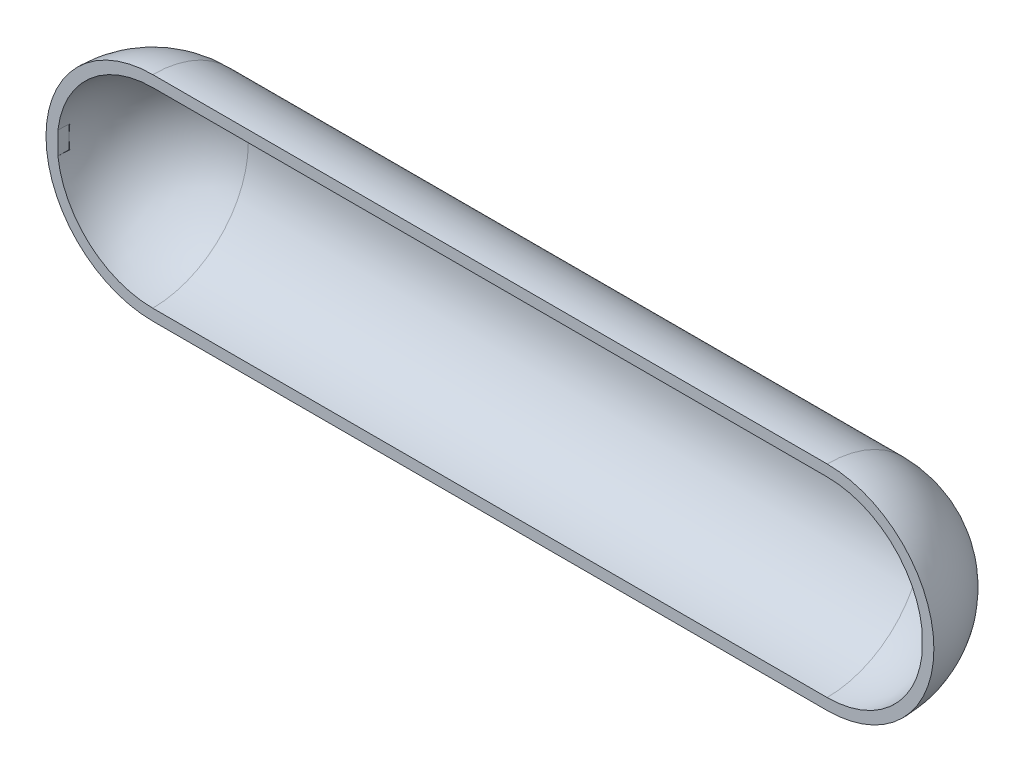
ISO-10303-21;
HEADER;
FILE_DESCRIPTION(('STEP AP214'),'2;1');
FILE_NAME('part.step','',(''),(''),'','','');
FILE_SCHEMA(('AUTOMOTIVE_DESIGN { 1 0 10303 214 1 1 1 1 }'));
ENDSEC;
DATA;
#1=APPLICATION_CONTEXT('core data for automotive mechanical design processes');
#2=APPLICATION_PROTOCOL_DEFINITION('international standard','automotive_design',2000,#1);
#3=PRODUCT_CONTEXT('',#1,'mechanical');
#4=PRODUCT('Part','Part','',(#3));
#5=PRODUCT_RELATED_PRODUCT_CATEGORY('part','',(#4));
#6=PRODUCT_DEFINITION_FORMATION('','',#4);
#7=PRODUCT_DEFINITION_CONTEXT('part definition',#1,'design');
#8=PRODUCT_DEFINITION('design','',#6,#7);
#9=PRODUCT_DEFINITION_SHAPE('','',#8);
#10=(LENGTH_UNIT() NAMED_UNIT(*) SI_UNIT(.MILLI.,.METRE.));
#11=(NAMED_UNIT(*) PLANE_ANGLE_UNIT() SI_UNIT($,.RADIAN.));
#12=(NAMED_UNIT(*) SI_UNIT($,.STERADIAN.) SOLID_ANGLE_UNIT());
#13=UNCERTAINTY_MEASURE_WITH_UNIT(LENGTH_MEASURE(1.E-05),#10,'distance_accuracy_value','');
#14=(GEOMETRIC_REPRESENTATION_CONTEXT(3) GLOBAL_UNCERTAINTY_ASSIGNED_CONTEXT((#13)) GLOBAL_UNIT_ASSIGNED_CONTEXT((#10,
#11,#12)) REPRESENTATION_CONTEXT('',''));
#15=CARTESIAN_POINT('',(0.,0.,0.));
#16=DIRECTION('',(0.,0.,1.));
#17=DIRECTION('',(1.,0.,0.));
#18=AXIS2_PLACEMENT_3D('',#15,#16,#17);
#19=CARTESIAN_POINT('',(-3000.,0.,0.));
#20=DIRECTION('',(0.,0.,1.));
#21=DIRECTION('',(1.,0.,0.));
#22=AXIS2_PLACEMENT_3D('',#19,#20,#21);
#23=PLANE('',#22);
#24=DIRECTION('',(0.,1.,0.));
#25=VECTOR('',#24,1.);
#26=CARTESIAN_POINT('',(3844.09715080671,-99.9999999999999,0.));
#27=LINE('',#26,#25);
#28=CARTESIAN_POINT('',(3844.09715080671,-99.9999999999999,0.));
#29=VERTEX_POINT('',#28);
#30=CARTESIAN_POINT('',(3844.09715080671,99.9999999999999,0.));
#31=VERTEX_POINT('',#30);
#32=EDGE_CURVE('E128',#29,#31,#27,.T.);
#33=ORIENTED_EDGE('',*,*,#32,.F.);
#34=CARTESIAN_POINT('',(3000.,0.,0.));
#35=DIRECTION('',(0.,0.,-1.));
#36=DIRECTION('',(1.,0.,0.));
#37=AXIS2_PLACEMENT_3D('',#34,#35,#36);
#38=CIRCLE('',#37,850.);
#39=CARTESIAN_POINT('',(3000.,-850.,5.93551827603332E-12));
#40=VERTEX_POINT('',#39);
#41=EDGE_CURVE('E205',#29,#40,#38,.T.);
#42=ORIENTED_EDGE('',*,*,#41,.T.);
#43=DIRECTION('',(1.,0.,0.));
#44=VECTOR('',#43,1.);
#45=CARTESIAN_POINT('',(0.,-850.,5.93551827603332E-12));
#46=LINE('',#45,#44);
#47=CARTESIAN_POINT('',(-3000.,-850.,5.93551827603333E-12));
#48=VERTEX_POINT('',#47);
#49=EDGE_CURVE('E201',#48,#40,#46,.T.);
#50=ORIENTED_EDGE('',*,*,#49,.F.);
#51=CARTESIAN_POINT('',(-3000.,2.04702037756213E-13,0.));
#52=DIRECTION('',(0.,0.,-1.));
#53=DIRECTION('',(1.,0.,0.));
#54=AXIS2_PLACEMENT_3D('',#51,#52,#53);
#55=CIRCLE('',#54,850.);
#56=CARTESIAN_POINT('',(-3844.09715080671,-99.9999999999999,0.));
#57=VERTEX_POINT('',#56);
#58=EDGE_CURVE('E197',#48,#57,#55,.T.);
#59=ORIENTED_EDGE('',*,*,#58,.T.);
#60=DIRECTION('',(0.,-1.,0.));
#61=VECTOR('',#60,1.);
#62=CARTESIAN_POINT('',(-3844.09715080671,100.,0.));
#63=LINE('',#62,#61);
#64=CARTESIAN_POINT('',(-3844.09715080671,100.,0.));
#65=VERTEX_POINT('',#64);
#66=EDGE_CURVE('E158',#65,#57,#63,.T.);
#67=ORIENTED_EDGE('',*,*,#66,.F.);
#68=CARTESIAN_POINT('',(-3000.,0.,0.));
#69=DIRECTION('',(0.,0.,1.));
#70=DIRECTION('',(1.,0.,0.));
#71=AXIS2_PLACEMENT_3D('',#68,#69,#70);
#72=CIRCLE('',#71,850.);
#73=CARTESIAN_POINT('',(-3000.,850.,0.));
#74=VERTEX_POINT('',#73);
#75=EDGE_CURVE('E185',#74,#65,#72,.T.);
#76=ORIENTED_EDGE('',*,*,#75,.F.);
#77=DIRECTION('',(1.,0.,0.));
#78=VECTOR('',#77,1.);
#79=CARTESIAN_POINT('',(0.,850.,0.));
#80=LINE('',#79,#78);
#81=CARTESIAN_POINT('',(3000.,850.,0.));
#82=VERTEX_POINT('',#81);
#83=EDGE_CURVE('E189',#74,#82,#80,.T.);
#84=ORIENTED_EDGE('',*,*,#83,.T.);
#85=CARTESIAN_POINT('',(3000.,0.,0.));
#86=DIRECTION('',(0.,0.,1.));
#87=DIRECTION('',(1.,0.,0.));
#88=AXIS2_PLACEMENT_3D('',#85,#86,#87);
#89=CIRCLE('',#88,850.);
#90=EDGE_CURVE('E193',#31,#82,#89,.T.);
#91=ORIENTED_EDGE('',*,*,#90,.F.);
#92=EDGE_LOOP('',(#33,#42,#50,#59,#67,#76,#84,#91));
#93=FACE_BOUND('',#92,.T.);
#94=DIRECTION('',(1.,0.,0.));
#95=VECTOR('',#94,1.);
#96=CARTESIAN_POINT('',(0.,950.,0.));
#97=LINE('',#96,#95);
#98=CARTESIAN_POINT('',(-3000.,950.,0.));
#99=VERTEX_POINT('',#98);
#100=CARTESIAN_POINT('',(3000.,950.,0.));
#101=VERTEX_POINT('',#100);
#102=EDGE_CURVE('E216',#99,#101,#97,.T.);
#103=ORIENTED_EDGE('',*,*,#102,.F.);
#104=CARTESIAN_POINT('',(-3000.,2.04702037756213E-13,0.));
#105=DIRECTION('',(0.,0.,-1.));
#106=DIRECTION('',(1.,0.,0.));
#107=AXIS2_PLACEMENT_3D('',#104,#105,#106);
#108=CIRCLE('',#107,950.);
#109=CARTESIAN_POINT('',(-3000.,-950.,6.63381454380195E-12));
#110=VERTEX_POINT('',#109);
#111=EDGE_CURVE('E220',#110,#99,#108,.T.);
#112=ORIENTED_EDGE('',*,*,#111,.F.);
#113=DIRECTION('',(1.,0.,0.));
#114=VECTOR('',#113,1.);
#115=CARTESIAN_POINT('',(0.,-950.,6.63381454380195E-12));
#116=LINE('',#115,#114);
#117=CARTESIAN_POINT('',(3000.,-950.,6.63381454380195E-12));
#118=VERTEX_POINT('',#117);
#119=EDGE_CURVE('E223',#110,#118,#116,.T.);
#120=ORIENTED_EDGE('',*,*,#119,.T.);
#121=CARTESIAN_POINT('',(3000.,0.,0.));
#122=DIRECTION('',(0.,0.,-1.));
#123=DIRECTION('',(1.,0.,0.));
#124=AXIS2_PLACEMENT_3D('',#121,#122,#123);
#125=CIRCLE('',#124,950.);
#126=EDGE_CURVE('E227',#101,#118,#125,.T.);
#127=ORIENTED_EDGE('',*,*,#126,.F.);
#128=EDGE_LOOP('',(#103,#112,#120,#127));
#129=FACE_BOUND('',#128,.T.);
#130=ADVANCED_FACE('F39',(#93,#129),#23,.T.);
#131=CARTESIAN_POINT('',(3000.,0.,0.));
#132=DIRECTION('',(1.,0.,0.));
#133=DIRECTION('',(0.,1.,0.));
#134=AXIS2_PLACEMENT_3D('',#131,#132,#133);
#135=SPHERICAL_SURFACE('',#134,950.);
#136=CARTESIAN_POINT('',(3000.,0.,0.));
#137=DIRECTION('',(1.,0.,0.));
#138=DIRECTION('',(0.,1.,0.));
#139=AXIS2_PLACEMENT_3D('',#136,#137,#138);
#140=CIRCLE('',#139,950.);
#141=EDGE_CURVE('E235',#118,#101,#140,.T.);
#142=ORIENTED_EDGE('',*,*,#141,.T.);
#143=ORIENTED_EDGE('',*,*,#126,.T.);
#144=EDGE_LOOP('',(#142,#143));
#145=FACE_BOUND('',#144,.T.);
#146=ADVANCED_FACE('F41',(#145),#135,.T.);
#147=CARTESIAN_POINT('',(3950.,0.,0.));
#148=DIRECTION('',(1.,0.,0.));
#149=DIRECTION('',(0.,1.,0.));
#150=AXIS2_PLACEMENT_3D('',#147,#148,#149);
#151=CYLINDRICAL_SURFACE('',#150,950.);
#152=CARTESIAN_POINT('',(-3000.,1.02351018878106E-13,0.));
#153=DIRECTION('',(1.,0.,0.));
#154=DIRECTION('',(0.,1.,0.));
#155=AXIS2_PLACEMENT_3D('',#152,#153,#154);
#156=CIRCLE('',#155,950.);
#157=EDGE_CURVE('E231',#110,#99,#156,.T.);
#158=ORIENTED_EDGE('',*,*,#157,.T.);
#159=ORIENTED_EDGE('',*,*,#102,.T.);
#160=ORIENTED_EDGE('',*,*,#141,.F.);
#161=ORIENTED_EDGE('',*,*,#119,.F.);
#162=EDGE_LOOP('',(#158,#159,#160,#161));
#163=FACE_BOUND('',#162,.T.);
#164=ADVANCED_FACE('F281',(#163),#151,.T.);
#165=CARTESIAN_POINT('',(-3000.,2.04702037756213E-13,0.));
#166=DIRECTION('',(1.,0.,0.));
#167=DIRECTION('',(0.,-1.,0.));
#168=AXIS2_PLACEMENT_3D('',#165,#166,#167);
#169=SPHERICAL_SURFACE('',#168,950.);
#170=ORIENTED_EDGE('',*,*,#111,.T.);
#171=ORIENTED_EDGE('',*,*,#157,.F.);
#172=EDGE_LOOP('',(#170,#171));
#173=FACE_BOUND('',#172,.T.);
#174=ADVANCED_FACE('F287',(#173),#169,.T.);
#175=CARTESIAN_POINT('',(3000.,0.,0.));
#176=DIRECTION('',(1.,0.,0.));
#177=DIRECTION('',(0.,-1.,0.));
#178=AXIS2_PLACEMENT_3D('',#175,#176,#177);
#179=SPHERICAL_SURFACE('',#178,850.);
#180=CARTESIAN_POINT('',(3000.,0.,-100.));
#181=DIRECTION('',(0.,0.,1.));
#182=DIRECTION('',(1.,0.,0.));
#183=AXIS2_PLACEMENT_3D('',#180,#181,#182);
#184=CIRCLE('',#183,844.097150806707);
#185=CARTESIAN_POINT('',(3838.15273071201,99.9999999999999,-100.));
#186=VERTEX_POINT('',#185);
#187=CARTESIAN_POINT('',(3844.09715080671,0.,-100.));
#188=VERTEX_POINT('',#187);
#189=EDGE_CURVE('E167',#186,#188,#184,.F.);
#190=ORIENTED_EDGE('',*,*,#189,.F.);
#191=CARTESIAN_POINT('',(3000.,99.9999999999999,0.));
#192=DIRECTION('',(0.,1.,0.));
#193=DIRECTION('',(-1.,0.,0.));
#194=AXIS2_PLACEMENT_3D('',#191,#192,#193);
#195=CIRCLE('',#194,844.097150806707);
#196=EDGE_CURVE('E181',#186,#31,#195,.F.);
#197=ORIENTED_EDGE('',*,*,#196,.T.);
#198=ORIENTED_EDGE('',*,*,#90,.T.);
#199=CARTESIAN_POINT('',(3000.,0.,0.));
#200=DIRECTION('',(1.,0.,0.));
#201=DIRECTION('',(0.,1.,0.));
#202=AXIS2_PLACEMENT_3D('',#199,#200,#201);
#203=CIRCLE('',#202,850.);
#204=EDGE_CURVE('E213',#40,#82,#203,.T.);
#205=ORIENTED_EDGE('',*,*,#204,.F.);
#206=ORIENTED_EDGE('',*,*,#41,.F.);
#207=CARTESIAN_POINT('',(3000.,-99.9999999999999,0.));
#208=DIRECTION('',(0.,-1.,0.));
#209=DIRECTION('',(1.,0.,0.));
#210=AXIS2_PLACEMENT_3D('',#207,#208,#209);
#211=CIRCLE('',#210,844.097150806707);
#212=CARTESIAN_POINT('',(3838.15273071201,-99.9999999999999,-100.));
#213=VERTEX_POINT('',#212);
#214=EDGE_CURVE('E177',#29,#213,#211,.F.);
#215=ORIENTED_EDGE('',*,*,#214,.T.);
#216=EDGE_CURVE('E176',#188,#213,#184,.F.);
#217=ORIENTED_EDGE('',*,*,#216,.F.);
#218=EDGE_LOOP('',(#190,#197,#198,#205,#206,#215,#217));
#219=FACE_BOUND('',#218,.T.);
#220=ADVANCED_FACE('F285',(#219),#179,.F.);
#221=CARTESIAN_POINT('',(3950.,0.,0.));
#222=DIRECTION('',(1.,0.,0.));
#223=DIRECTION('',(0.,1.,0.));
#224=AXIS2_PLACEMENT_3D('',#221,#222,#223);
#225=CYLINDRICAL_SURFACE('',#224,850.);
#226=CARTESIAN_POINT('',(-3000.,1.02351018878106E-13,0.));
#227=DIRECTION('',(1.,0.,0.));
#228=DIRECTION('',(0.,1.,0.));
#229=AXIS2_PLACEMENT_3D('',#226,#227,#228);
#230=CIRCLE('',#229,850.);
#231=EDGE_CURVE('E209',#48,#74,#230,.T.);
#232=ORIENTED_EDGE('',*,*,#231,.F.);
#233=ORIENTED_EDGE('',*,*,#49,.T.);
#234=ORIENTED_EDGE('',*,*,#204,.T.);
#235=ORIENTED_EDGE('',*,*,#83,.F.);
#236=EDGE_LOOP('',(#232,#233,#234,#235));
#237=FACE_BOUND('',#236,.T.);
#238=ADVANCED_FACE('F310',(#237),#225,.F.);
#239=CARTESIAN_POINT('',(-3000.,2.04702037756213E-13,0.));
#240=DIRECTION('',(1.,0.,0.));
#241=DIRECTION('',(0.,-1.,0.));
#242=AXIS2_PLACEMENT_3D('',#239,#240,#241);
#243=SPHERICAL_SURFACE('',#242,850.);
#244=ORIENTED_EDGE('',*,*,#75,.T.);
#245=CARTESIAN_POINT('',(-3000.,100.,0.));
#246=DIRECTION('',(0.,1.,0.));
#247=DIRECTION('',(-1.,0.,0.));
#248=AXIS2_PLACEMENT_3D('',#245,#246,#247);
#249=CIRCLE('',#248,844.097150806707);
#250=CARTESIAN_POINT('',(-3838.15273071201,100.,-100.));
#251=VERTEX_POINT('',#250);
#252=EDGE_CURVE('E11',#65,#251,#249,.F.);
#253=ORIENTED_EDGE('',*,*,#252,.T.);
#254=CARTESIAN_POINT('',(-3000.,2.04702037756213E-13,-100.));
#255=DIRECTION('',(0.,0.,1.));
#256=DIRECTION('',(1.,0.,0.));
#257=AXIS2_PLACEMENT_3D('',#254,#255,#256);
#258=CIRCLE('',#257,844.097150806707);
#259=CARTESIAN_POINT('',(-3844.09715080671,1.65957348952724E-13,-100.));
#260=VERTEX_POINT('',#259);
#261=EDGE_CURVE('E125',#260,#251,#258,.F.);
#262=ORIENTED_EDGE('',*,*,#261,.F.);
#263=CARTESIAN_POINT('',(-3838.15273071201,-99.9999999999999,-100.));
#264=VERTEX_POINT('',#263);
#265=EDGE_CURVE('E240',#264,#260,#258,.F.);
#266=ORIENTED_EDGE('',*,*,#265,.F.);
#267=CARTESIAN_POINT('',(-3000.,-99.9999999999999,0.));
#268=DIRECTION('',(0.,-1.,0.));
#269=DIRECTION('',(1.,0.,0.));
#270=AXIS2_PLACEMENT_3D('',#267,#268,#269);
#271=CIRCLE('',#270,844.097150806707);
#272=EDGE_CURVE('E48',#264,#57,#271,.F.);
#273=ORIENTED_EDGE('',*,*,#272,.T.);
#274=ORIENTED_EDGE('',*,*,#58,.F.);
#275=ORIENTED_EDGE('',*,*,#231,.T.);
#276=EDGE_LOOP('',(#244,#253,#262,#266,#273,#274,#275));
#277=FACE_BOUND('',#276,.T.);
#278=ADVANCED_FACE('F250',(#277),#243,.F.);
#279=CARTESIAN_POINT('',(0.,0.,-100.));
#280=DIRECTION('',(0.,0.,1.));
#281=DIRECTION('',(1.,0.,0.));
#282=AXIS2_PLACEMENT_3D('',#279,#280,#281);
#283=PLANE('',#282);
#284=ORIENTED_EDGE('',*,*,#261,.T.);
#285=DIRECTION('',(-1.,0.,0.));
#286=VECTOR('',#285,1.);
#287=CARTESIAN_POINT('',(3844.09715080671,99.9999999999999,-100.));
#288=LINE('',#287,#286);
#289=CARTESIAN_POINT('',(-3844.09715080671,100.,-100.));
#290=VERTEX_POINT('',#289);
#291=EDGE_CURVE('E121',#251,#290,#288,.T.);
#292=ORIENTED_EDGE('',*,*,#291,.T.);
#293=DIRECTION('',(0.,-1.,0.));
#294=VECTOR('',#293,1.);
#295=CARTESIAN_POINT('',(-3844.09715080671,100.,-100.));
#296=LINE('',#295,#294);
#297=EDGE_CURVE('E63',#290,#260,#296,.T.);
#298=ORIENTED_EDGE('',*,*,#297,.T.);
#299=EDGE_LOOP('',(#284,#292,#298));
#300=FACE_BOUND('',#299,.T.);
#301=ADVANCED_FACE('F123',(#300),#283,.T.);
#302=CARTESIAN_POINT('',(3844.09715080671,99.9999999999999,-100.));
#303=DIRECTION('',(0.,1.,0.));
#304=DIRECTION('',(-1.,0.,0.));
#305=AXIS2_PLACEMENT_3D('',#302,#303,#304);
#306=PLANE('',#305);
#307=DIRECTION('',(0.,0.,1.));
#308=VECTOR('',#307,1.);
#309=CARTESIAN_POINT('',(-3844.09715080671,100.,-100.));
#310=LINE('',#309,#308);
#311=EDGE_CURVE('E131',#290,#65,#310,.T.);
#312=ORIENTED_EDGE('',*,*,#311,.F.);
#313=ORIENTED_EDGE('',*,*,#291,.F.);
#314=ORIENTED_EDGE('',*,*,#252,.F.);
#315=EDGE_LOOP('',(#312,#313,#314));
#316=FACE_BOUND('',#315,.T.);
#317=ADVANCED_FACE('F132',(#316),#306,.F.);
#318=CARTESIAN_POINT('',(-3844.09715080671,100.,-100.));
#319=DIRECTION('',(-1.,0.,0.));
#320=DIRECTION('',(0.,0.,1.));
#321=AXIS2_PLACEMENT_3D('',#318,#319,#320);
#322=PLANE('',#321);
#323=DIRECTION('',(0.,0.,1.));
#324=VECTOR('',#323,1.);
#325=CARTESIAN_POINT('',(-3844.09715080671,-99.9999999999999,-100.));
#326=LINE('',#325,#324);
#327=CARTESIAN_POINT('',(-3844.09715080671,-99.9999999999999,-100.));
#328=VERTEX_POINT('',#327);
#329=EDGE_CURVE('E137',#328,#57,#326,.T.);
#330=ORIENTED_EDGE('',*,*,#329,.F.);
#331=EDGE_CURVE('E142',#260,#328,#296,.T.);
#332=ORIENTED_EDGE('',*,*,#331,.F.);
#333=ORIENTED_EDGE('',*,*,#297,.F.);
#334=ORIENTED_EDGE('',*,*,#311,.T.);
#335=ORIENTED_EDGE('',*,*,#66,.T.);
#336=EDGE_LOOP('',(#330,#332,#333,#334,#335));
#337=FACE_BOUND('',#336,.T.);
#338=ADVANCED_FACE('F141',(#337),#322,.F.);
#339=ORIENTED_EDGE('',*,*,#265,.T.);
#340=ORIENTED_EDGE('',*,*,#331,.T.);
#341=DIRECTION('',(1.,0.,0.));
#342=VECTOR('',#341,1.);
#343=CARTESIAN_POINT('',(-3844.09715080671,-99.9999999999999,-100.));
#344=LINE('',#343,#342);
#345=EDGE_CURVE('E149',#328,#264,#344,.T.);
#346=ORIENTED_EDGE('',*,*,#345,.T.);
#347=EDGE_LOOP('',(#339,#340,#346));
#348=FACE_BOUND('',#347,.T.);
#349=ADVANCED_FACE('F248',(#348),#283,.T.);
#350=CARTESIAN_POINT('',(-3844.09715080671,-99.9999999999999,-100.));
#351=DIRECTION('',(0.,-1.,0.));
#352=DIRECTION('',(1.,0.,0.));
#353=AXIS2_PLACEMENT_3D('',#350,#351,#352);
#354=PLANE('',#353);
#355=ORIENTED_EDGE('',*,*,#345,.F.);
#356=ORIENTED_EDGE('',*,*,#329,.T.);
#357=ORIENTED_EDGE('',*,*,#272,.F.);
#358=EDGE_LOOP('',(#355,#356,#357));
#359=FACE_BOUND('',#358,.T.);
#360=ADVANCED_FACE('F258',(#359),#354,.F.);
#361=CARTESIAN_POINT('',(3844.09715080671,-99.9999999999999,-100.));
#362=DIRECTION('',(1.,0.,0.));
#363=DIRECTION('',(0.,0.,-1.));
#364=AXIS2_PLACEMENT_3D('',#361,#362,#363);
#365=PLANE('',#364);
#366=DIRECTION('',(0.,1.,0.));
#367=VECTOR('',#366,1.);
#368=CARTESIAN_POINT('',(3844.09715080671,-99.9999999999999,-100.));
#369=LINE('',#368,#367);
#370=CARTESIAN_POINT('',(3844.09715080671,-99.9999999999999,-100.));
#371=VERTEX_POINT('',#370);
#372=EDGE_CURVE('E138',#371,#188,#369,.T.);
#373=ORIENTED_EDGE('',*,*,#372,.F.);
#374=DIRECTION('',(0.,0.,1.));
#375=VECTOR('',#374,1.);
#376=CARTESIAN_POINT('',(3844.09715080671,-99.9999999999999,-100.));
#377=LINE('',#376,#375);
#378=EDGE_CURVE('E168',#371,#29,#377,.T.);
#379=ORIENTED_EDGE('',*,*,#378,.T.);
#380=ORIENTED_EDGE('',*,*,#32,.T.);
#381=DIRECTION('',(0.,0.,1.));
#382=VECTOR('',#381,1.);
#383=CARTESIAN_POINT('',(3844.09715080671,99.9999999999999,-100.));
#384=LINE('',#383,#382);
#385=CARTESIAN_POINT('',(3844.09715080671,99.9999999999999,-100.));
#386=VERTEX_POINT('',#385);
#387=EDGE_CURVE('E164',#386,#31,#384,.T.);
#388=ORIENTED_EDGE('',*,*,#387,.F.);
#389=EDGE_CURVE('E154',#188,#386,#369,.T.);
#390=ORIENTED_EDGE('',*,*,#389,.F.);
#391=EDGE_LOOP('',(#373,#379,#380,#388,#390));
#392=FACE_BOUND('',#391,.T.);
#393=ADVANCED_FACE('F260',(#392),#365,.F.);
#394=EDGE_CURVE('E55',#386,#186,#288,.T.);
#395=ORIENTED_EDGE('',*,*,#394,.F.);
#396=ORIENTED_EDGE('',*,*,#387,.T.);
#397=ORIENTED_EDGE('',*,*,#196,.F.);
#398=EDGE_LOOP('',(#395,#396,#397));
#399=FACE_BOUND('',#398,.T.);
#400=ADVANCED_FACE('F267',(#399),#306,.F.);
#401=ORIENTED_EDGE('',*,*,#378,.F.);
#402=EDGE_CURVE('E145',#213,#371,#344,.T.);
#403=ORIENTED_EDGE('',*,*,#402,.F.);
#404=ORIENTED_EDGE('',*,*,#214,.F.);
#405=EDGE_LOOP('',(#401,#403,#404));
#406=FACE_BOUND('',#405,.T.);
#407=ADVANCED_FACE('F262',(#406),#354,.F.);
#408=ORIENTED_EDGE('',*,*,#216,.T.);
#409=ORIENTED_EDGE('',*,*,#402,.T.);
#410=ORIENTED_EDGE('',*,*,#372,.T.);
#411=EDGE_LOOP('',(#408,#409,#410));
#412=FACE_BOUND('',#411,.T.);
#413=ADVANCED_FACE('F274',(#412),#283,.T.);
#414=ORIENTED_EDGE('',*,*,#189,.T.);
#415=ORIENTED_EDGE('',*,*,#389,.T.);
#416=ORIENTED_EDGE('',*,*,#394,.T.);
#417=EDGE_LOOP('',(#414,#415,#416));
#418=FACE_BOUND('',#417,.T.);
#419=ADVANCED_FACE('F271',(#418),#283,.T.);
#420=CLOSED_SHELL('',(#130,#146,#164,#174,#220,#238,#278,#301,#317,#338,#349,#360,#393,#400,
#407,#413,#419));
#421=MANIFOLD_SOLID_BREP('B2',#420);
#422=ADVANCED_BREP_SHAPE_REPRESENTATION('',(#18,#421),#14);
#423=SHAPE_DEFINITION_REPRESENTATION(#9,#422);
ENDSEC;
END-ISO-10303-21;
